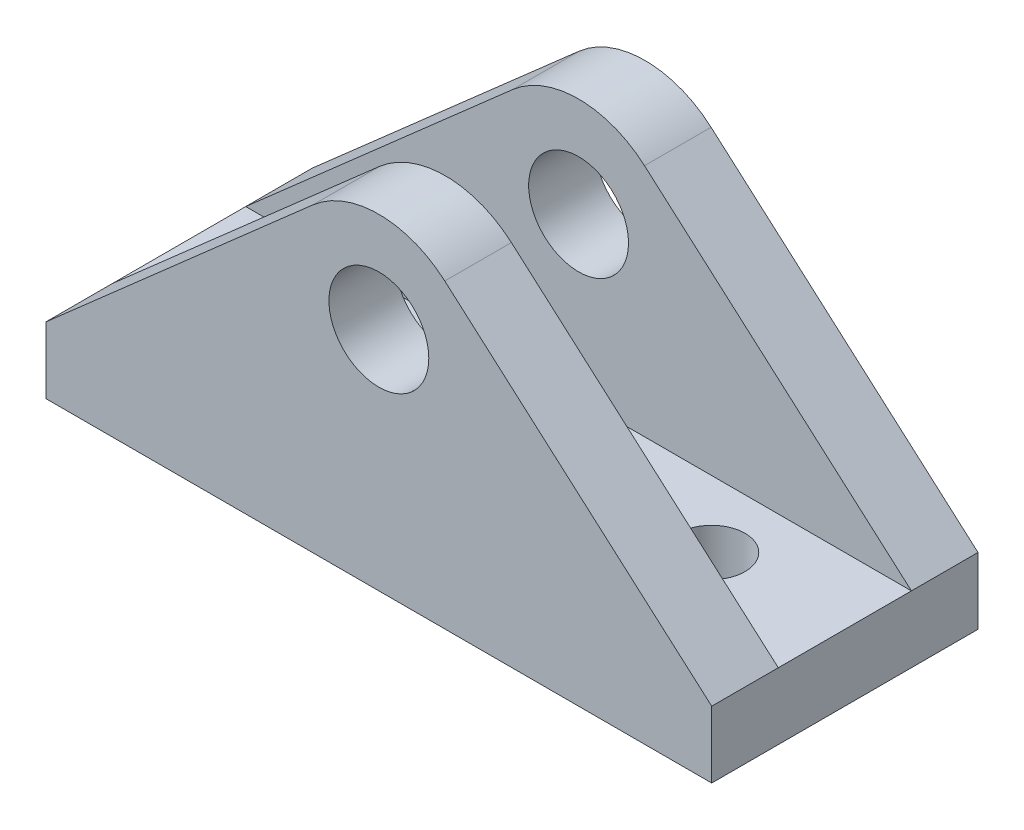
ISO-10303-21;
HEADER;
FILE_DESCRIPTION(('STEP AP214'),'2;1');
FILE_NAME('part.step','',(''),(''),'','','');
FILE_SCHEMA(('AUTOMOTIVE_DESIGN { 1 0 10303 214 1 1 1 1 }'));
ENDSEC;
DATA;
#1=APPLICATION_CONTEXT('core data for automotive mechanical design processes');
#2=APPLICATION_PROTOCOL_DEFINITION('international standard','automotive_design',2000,#1);
#3=PRODUCT_CONTEXT('',#1,'mechanical');
#4=PRODUCT('Part','Part','',(#3));
#5=PRODUCT_RELATED_PRODUCT_CATEGORY('part','',(#4));
#6=PRODUCT_DEFINITION_FORMATION('','',#4);
#7=PRODUCT_DEFINITION_CONTEXT('part definition',#1,'design');
#8=PRODUCT_DEFINITION('design','',#6,#7);
#9=PRODUCT_DEFINITION_SHAPE('','',#8);
#10=(LENGTH_UNIT() NAMED_UNIT(*) SI_UNIT(.MILLI.,.METRE.));
#11=(NAMED_UNIT(*) PLANE_ANGLE_UNIT() SI_UNIT($,.RADIAN.));
#12=(NAMED_UNIT(*) SI_UNIT($,.STERADIAN.) SOLID_ANGLE_UNIT());
#13=UNCERTAINTY_MEASURE_WITH_UNIT(LENGTH_MEASURE(1.E-05),#10,'distance_accuracy_value','');
#14=(GEOMETRIC_REPRESENTATION_CONTEXT(3) GLOBAL_UNCERTAINTY_ASSIGNED_CONTEXT((#13)) GLOBAL_UNIT_ASSIGNED_CONTEXT((#10,
#11,#12)) REPRESENTATION_CONTEXT('',''));
#15=CARTESIAN_POINT('',(0.,0.,0.));
#16=DIRECTION('',(0.,0.,1.));
#17=DIRECTION('',(1.,0.,0.));
#18=AXIS2_PLACEMENT_3D('',#15,#16,#17);
#19=CARTESIAN_POINT('',(-9.43958665267273,10.732585613282,25.4));
#20=DIRECTION('',(0.660427227284446,-0.750890056840133,0.));
#21=DIRECTION('',(0.750890056840133,0.660427227284446,0.));
#22=AXIS2_PLACEMENT_3D('',#19,#20,#21);
#23=PLANE('',#22);
#24=DIRECTION('',(-0.750890056840133,-0.660427227284446,0.));
#25=VECTOR('',#24,1.);
#26=CARTESIAN_POINT('',(-9.43958665267273,10.732585613282,6.35));
#27=LINE('',#26,#25);
#28=CARTESIAN_POINT('',(-6.29056933988435,13.5022277914023,6.35));
#29=VERTEX_POINT('',#28);
#30=CARTESIAN_POINT('',(-31.7499999999431,-8.88999999999998,6.35));
#31=VERTEX_POINT('',#30);
#32=EDGE_CURVE('E147',#29,#31,#27,.T.);
#33=ORIENTED_EDGE('',*,*,#32,.F.);
#34=DIRECTION('',(0.,0.,-1.));
#35=VECTOR('',#34,1.);
#36=CARTESIAN_POINT('',(-6.29056933988435,13.5022277914023,25.4));
#37=LINE('',#36,#35);
#38=CARTESIAN_POINT('',(-6.29056933988435,13.5022277914023,0.));
#39=VERTEX_POINT('',#38);
#40=EDGE_CURVE('E91',#29,#39,#37,.T.);
#41=ORIENTED_EDGE('',*,*,#40,.T.);
#42=DIRECTION('',(-0.750890056840133,-0.660427227284446,0.));
#43=VECTOR('',#42,1.);
#44=CARTESIAN_POINT('',(-9.43958665267273,10.732585613282,0.));
#45=LINE('',#44,#43);
#46=CARTESIAN_POINT('',(-31.7499999999431,-8.89,0.));
#47=VERTEX_POINT('',#46);
#48=EDGE_CURVE('E144',#39,#47,#45,.T.);
#49=ORIENTED_EDGE('',*,*,#48,.T.);
#50=DIRECTION('',(0.,0.,-1.));
#51=VECTOR('',#50,1.);
#52=CARTESIAN_POINT('',(-31.7499999999431,-8.89,25.4));
#53=LINE('',#52,#51);
#54=EDGE_CURVE('E45',#31,#47,#53,.T.);
#55=ORIENTED_EDGE('',*,*,#54,.F.);
#56=EDGE_LOOP('',(#33,#41,#49,#55));
#57=FACE_BOUND('',#56,.T.);
#58=ADVANCED_FACE('F36',(#57),#23,.F.);
#59=CARTESIAN_POINT('',(9.43958665267273,10.732585613282,25.4));
#60=DIRECTION('',(0.660427227284446,0.750890056840133,0.));
#61=DIRECTION('',(-0.750890056840133,0.660427227284446,0.));
#62=AXIS2_PLACEMENT_3D('',#59,#60,#61);
#63=PLANE('',#62);
#64=DIRECTION('',(0.,0.,-1.));
#65=VECTOR('',#64,1.);
#66=CARTESIAN_POINT('',(6.29056933988435,13.5022277914023,25.4));
#67=LINE('',#66,#65);
#68=CARTESIAN_POINT('',(6.29056933988435,13.5022277914023,6.35));
#69=VERTEX_POINT('',#68);
#70=CARTESIAN_POINT('',(6.29056933988435,13.5022277914023,0.));
#71=VERTEX_POINT('',#70);
#72=EDGE_CURVE('E165',#69,#71,#67,.T.);
#73=ORIENTED_EDGE('',*,*,#72,.F.);
#74=DIRECTION('',(0.750890056840133,-0.660427227284446,0.));
#75=VECTOR('',#74,1.);
#76=CARTESIAN_POINT('',(9.43958665267273,10.732585613282,6.35));
#77=LINE('',#76,#75);
#78=CARTESIAN_POINT('',(31.7499999999431,-8.88999999999998,6.35));
#79=VERTEX_POINT('',#78);
#80=EDGE_CURVE('E198',#69,#79,#77,.T.);
#81=ORIENTED_EDGE('',*,*,#80,.T.);
#82=DIRECTION('',(0.,0.,-1.));
#83=VECTOR('',#82,1.);
#84=CARTESIAN_POINT('',(31.7499999999431,-8.88999999999998,25.4));
#85=LINE('',#84,#83);
#86=CARTESIAN_POINT('',(31.7499999999431,-8.88999999999998,0.));
#87=VERTEX_POINT('',#86);
#88=EDGE_CURVE('E132',#79,#87,#85,.T.);
#89=ORIENTED_EDGE('',*,*,#88,.T.);
#90=DIRECTION('',(0.750890056840133,-0.660427227284446,0.));
#91=VECTOR('',#90,1.);
#92=CARTESIAN_POINT('',(9.43958665267273,10.732585613282,0.));
#93=LINE('',#92,#91);
#94=EDGE_CURVE('E154',#71,#87,#93,.T.);
#95=ORIENTED_EDGE('',*,*,#94,.F.);
#96=EDGE_LOOP('',(#73,#81,#89,#95));
#97=FACE_BOUND('',#96,.T.);
#98=ADVANCED_FACE('F221',(#97),#63,.T.);
#99=CARTESIAN_POINT('',(0.,6.35,25.4));
#100=DIRECTION('',(0.,0.,-1.));
#101=DIRECTION('',(-1.,0.,0.));
#102=AXIS2_PLACEMENT_3D('',#99,#100,#101);
#103=CYLINDRICAL_SURFACE('',#102,9.525);
#104=CARTESIAN_POINT('',(0.,6.35,6.35));
#105=DIRECTION('',(0.,0.,1.));
#106=DIRECTION('',(1.,0.,0.));
#107=AXIS2_PLACEMENT_3D('',#104,#105,#106);
#108=CIRCLE('',#107,9.525);
#109=EDGE_CURVE('E195',#69,#29,#108,.T.);
#110=ORIENTED_EDGE('',*,*,#109,.F.);
#111=ORIENTED_EDGE('',*,*,#72,.T.);
#112=CARTESIAN_POINT('',(0.,6.35,0.));
#113=DIRECTION('',(0.,0.,1.));
#114=DIRECTION('',(1.,0.,0.));
#115=AXIS2_PLACEMENT_3D('',#112,#113,#114);
#116=CIRCLE('',#115,9.525);
#117=EDGE_CURVE('E157',#71,#39,#116,.T.);
#118=ORIENTED_EDGE('',*,*,#117,.T.);
#119=ORIENTED_EDGE('',*,*,#40,.F.);
#120=EDGE_LOOP('',(#110,#111,#118,#119));
#121=FACE_BOUND('',#120,.T.);
#122=ADVANCED_FACE('F236',(#121),#103,.T.);
#123=CARTESIAN_POINT('',(0.,6.35,25.4));
#124=DIRECTION('',(0.,0.,-1.));
#125=DIRECTION('',(-1.,0.,0.));
#126=AXIS2_PLACEMENT_3D('',#123,#124,#125);
#127=CYLINDRICAL_SURFACE('',#126,4.7625);
#128=CARTESIAN_POINT('',(0.,6.35,0.));
#129=DIRECTION('',(0.,0.,1.));
#130=DIRECTION('',(1.,0.,0.));
#131=AXIS2_PLACEMENT_3D('',#128,#129,#130);
#132=CIRCLE('',#131,4.7625);
#133=CARTESIAN_POINT('',(4.7625,6.35,0.));
#134=VERTEX_POINT('',#133);
#135=EDGE_CURVE('E159',#134,#134,#132,.T.);
#136=ORIENTED_EDGE('',*,*,#135,.F.);
#137=EDGE_LOOP('',(#136));
#138=FACE_BOUND('',#137,.T.);
#139=CARTESIAN_POINT('',(0.,6.35,6.35));
#140=DIRECTION('',(0.,0.,1.));
#141=DIRECTION('',(1.,0.,0.));
#142=AXIS2_PLACEMENT_3D('',#139,#140,#141);
#143=CIRCLE('',#142,4.7625);
#144=CARTESIAN_POINT('',(4.7625,6.35,6.35));
#145=VERTEX_POINT('',#144);
#146=EDGE_CURVE('E40',#145,#145,#143,.T.);
#147=ORIENTED_EDGE('',*,*,#146,.T.);
#148=EDGE_LOOP('',(#147));
#149=FACE_BOUND('',#148,.T.);
#150=ADVANCED_FACE('F238',(#138,#149),#127,.F.);
#151=CARTESIAN_POINT('',(-6.29056933988435,13.5022277914023,25.4));
#152=VERTEX_POINT('',#151);
#153=CARTESIAN_POINT('',(-6.29056933988435,13.5022277914023,19.05));
#154=VERTEX_POINT('',#153);
#155=EDGE_CURVE('E162',#152,#154,#37,.T.);
#156=ORIENTED_EDGE('',*,*,#155,.T.);
#157=DIRECTION('',(-0.750890056840133,-0.660427227284446,0.));
#158=VECTOR('',#157,1.);
#159=CARTESIAN_POINT('',(-9.43958665267273,10.732585613282,19.05));
#160=LINE('',#159,#158);
#161=CARTESIAN_POINT('',(-31.7499999999431,-8.88999999999998,19.05));
#162=VERTEX_POINT('',#161);
#163=EDGE_CURVE('E53',#154,#162,#160,.T.);
#164=ORIENTED_EDGE('',*,*,#163,.T.);
#165=CARTESIAN_POINT('',(-31.7499999999431,-8.89,25.4));
#166=VERTEX_POINT('',#165);
#167=EDGE_CURVE('E11',#166,#162,#53,.T.);
#168=ORIENTED_EDGE('',*,*,#167,.F.);
#169=DIRECTION('',(-0.750890056840133,-0.660427227284446,0.));
#170=VECTOR('',#169,1.);
#171=CARTESIAN_POINT('',(-9.43958665267273,10.732585613282,25.4));
#172=LINE('',#171,#170);
#173=EDGE_CURVE('E97',#152,#166,#172,.T.);
#174=ORIENTED_EDGE('',*,*,#173,.F.);
#175=EDGE_LOOP('',(#156,#164,#168,#174));
#176=FACE_BOUND('',#175,.T.);
#177=ADVANCED_FACE('F38',(#176),#23,.F.);
#178=CARTESIAN_POINT('',(-31.7499999999431,0.,25.4));
#179=DIRECTION('',(-1.,0.,0.));
#180=DIRECTION('',(0.,0.,1.));
#181=AXIS2_PLACEMENT_3D('',#178,#179,#180);
#182=PLANE('',#181);
#183=DIRECTION('',(0.,1.,0.));
#184=VECTOR('',#183,1.);
#185=CARTESIAN_POINT('',(-31.7499999999431,0.,0.));
#186=LINE('',#185,#184);
#187=CARTESIAN_POINT('',(-31.7499999999431,-15.24,0.));
#188=VERTEX_POINT('',#187);
#189=EDGE_CURVE('E146',#188,#47,#186,.T.);
#190=ORIENTED_EDGE('',*,*,#189,.F.);
#191=DIRECTION('',(0.,0.,-1.));
#192=VECTOR('',#191,1.);
#193=CARTESIAN_POINT('',(-31.7499999999431,-15.24,25.4));
#194=LINE('',#193,#192);
#195=CARTESIAN_POINT('',(-31.7499999999431,-15.24,25.4));
#196=VERTEX_POINT('',#195);
#197=EDGE_CURVE('E168',#196,#188,#194,.T.);
#198=ORIENTED_EDGE('',*,*,#197,.F.);
#199=DIRECTION('',(0.,1.,0.));
#200=VECTOR('',#199,1.);
#201=CARTESIAN_POINT('',(-31.7499999999431,0.,25.4));
#202=LINE('',#201,#200);
#203=EDGE_CURVE('E202',#196,#166,#202,.T.);
#204=ORIENTED_EDGE('',*,*,#203,.T.);
#205=ORIENTED_EDGE('',*,*,#167,.T.);
#206=DIRECTION('',(0.,0.,1.));
#207=VECTOR('',#206,1.);
#208=CARTESIAN_POINT('',(-31.7499999999431,-8.88999999999998,0.));
#209=LINE('',#208,#207);
#210=EDGE_CURVE('E187',#31,#162,#209,.T.);
#211=ORIENTED_EDGE('',*,*,#210,.F.);
#212=ORIENTED_EDGE('',*,*,#54,.T.);
#213=EDGE_LOOP('',(#190,#198,#204,#205,#211,#212));
#214=FACE_BOUND('',#213,.T.);
#215=ADVANCED_FACE('F206',(#214),#182,.T.);
#216=CARTESIAN_POINT('',(0.,-15.24,25.4));
#217=DIRECTION('',(0.,1.,0.));
#218=DIRECTION('',(-1.,0.,0.));
#219=AXIS2_PLACEMENT_3D('',#216,#217,#218);
#220=PLANE('',#219);
#221=CARTESIAN_POINT('',(19.05,-15.24,12.7));
#222=DIRECTION('',(0.,1.,0.));
#223=DIRECTION('',(0.,0.,1.));
#224=AXIS2_PLACEMENT_3D('',#221,#222,#223);
#225=CIRCLE('',#224,3.175);
#226=CARTESIAN_POINT('',(19.05,-15.24,15.875));
#227=VERTEX_POINT('',#226);
#228=EDGE_CURVE('E261',#227,#227,#225,.T.);
#229=ORIENTED_EDGE('',*,*,#228,.T.);
#230=EDGE_LOOP('',(#229));
#231=FACE_BOUND('',#230,.T.);
#232=CARTESIAN_POINT('',(-19.05,-15.24,12.7));
#233=DIRECTION('',(0.,1.,0.));
#234=DIRECTION('',(0.,0.,1.));
#235=AXIS2_PLACEMENT_3D('',#232,#233,#234);
#236=CIRCLE('',#235,3.175);
#237=CARTESIAN_POINT('',(-19.05,-15.24,15.875));
#238=VERTEX_POINT('',#237);
#239=EDGE_CURVE('E263',#238,#238,#236,.T.);
#240=ORIENTED_EDGE('',*,*,#239,.T.);
#241=EDGE_LOOP('',(#240));
#242=FACE_BOUND('',#241,.T.);
#243=DIRECTION('',(1.,0.,0.));
#244=VECTOR('',#243,1.);
#245=CARTESIAN_POINT('',(0.,-15.24,0.));
#246=LINE('',#245,#244);
#247=CARTESIAN_POINT('',(31.7499999999431,-15.24,0.));
#248=VERTEX_POINT('',#247);
#249=EDGE_CURVE('E150',#188,#248,#246,.T.);
#250=ORIENTED_EDGE('',*,*,#249,.T.);
#251=DIRECTION('',(0.,0.,-1.));
#252=VECTOR('',#251,1.);
#253=CARTESIAN_POINT('',(31.7499999999431,-15.24,25.4));
#254=LINE('',#253,#252);
#255=CARTESIAN_POINT('',(31.7499999999431,-15.24,25.4));
#256=VERTEX_POINT('',#255);
#257=EDGE_CURVE('E131',#256,#248,#254,.T.);
#258=ORIENTED_EDGE('',*,*,#257,.F.);
#259=DIRECTION('',(1.,0.,0.));
#260=VECTOR('',#259,1.);
#261=CARTESIAN_POINT('',(0.,-15.24,25.4));
#262=LINE('',#261,#260);
#263=EDGE_CURVE('E115',#196,#256,#262,.T.);
#264=ORIENTED_EDGE('',*,*,#263,.F.);
#265=ORIENTED_EDGE('',*,*,#197,.T.);
#266=EDGE_LOOP('',(#250,#258,#264,#265));
#267=FACE_BOUND('',#266,.T.);
#268=ADVANCED_FACE('F211',(#231,#242,#267),#220,.F.);
#269=CARTESIAN_POINT('',(31.7499999999431,0.,25.4));
#270=DIRECTION('',(-1.,0.,0.));
#271=DIRECTION('',(0.,0.,1.));
#272=AXIS2_PLACEMENT_3D('',#269,#270,#271);
#273=PLANE('',#272);
#274=DIRECTION('',(0.,1.,0.));
#275=VECTOR('',#274,1.);
#276=CARTESIAN_POINT('',(31.7499999999431,0.,0.));
#277=LINE('',#276,#275);
#278=EDGE_CURVE('E152',#248,#87,#277,.T.);
#279=ORIENTED_EDGE('',*,*,#278,.T.);
#280=ORIENTED_EDGE('',*,*,#88,.F.);
#281=DIRECTION('',(0.,0.,1.));
#282=VECTOR('',#281,1.);
#283=CARTESIAN_POINT('',(31.7499999999431,-8.88999999999998,0.));
#284=LINE('',#283,#282);
#285=CARTESIAN_POINT('',(31.7499999999431,-8.88999999999998,19.05));
#286=VERTEX_POINT('',#285);
#287=EDGE_CURVE('E128',#79,#286,#284,.T.);
#288=ORIENTED_EDGE('',*,*,#287,.T.);
#289=CARTESIAN_POINT('',(31.7499999999431,-8.88999999999998,25.4));
#290=VERTEX_POINT('',#289);
#291=EDGE_CURVE('E122',#290,#286,#85,.T.);
#292=ORIENTED_EDGE('',*,*,#291,.F.);
#293=DIRECTION('',(0.,1.,0.));
#294=VECTOR('',#293,1.);
#295=CARTESIAN_POINT('',(31.7499999999431,0.,25.4));
#296=LINE('',#295,#294);
#297=EDGE_CURVE('E108',#256,#290,#296,.T.);
#298=ORIENTED_EDGE('',*,*,#297,.F.);
#299=ORIENTED_EDGE('',*,*,#257,.T.);
#300=EDGE_LOOP('',(#279,#280,#288,#292,#298,#299));
#301=FACE_BOUND('',#300,.T.);
#302=ADVANCED_FACE('F124',(#301),#273,.F.);
#303=DIRECTION('',(0.750890056840133,-0.660427227284446,0.));
#304=VECTOR('',#303,1.);
#305=CARTESIAN_POINT('',(9.43958665267273,10.732585613282,19.05));
#306=LINE('',#305,#304);
#307=CARTESIAN_POINT('',(6.29056933988435,13.5022277914023,19.05));
#308=VERTEX_POINT('',#307);
#309=EDGE_CURVE('E175',#308,#286,#306,.T.);
#310=ORIENTED_EDGE('',*,*,#309,.F.);
#311=CARTESIAN_POINT('',(6.29056933988435,13.5022277914023,25.4));
#312=VERTEX_POINT('',#311);
#313=EDGE_CURVE('E136',#312,#308,#67,.T.);
#314=ORIENTED_EDGE('',*,*,#313,.F.);
#315=DIRECTION('',(0.750890056840133,-0.660427227284446,0.));
#316=VECTOR('',#315,1.);
#317=CARTESIAN_POINT('',(9.43958665267273,10.732585613282,25.4));
#318=LINE('',#317,#316);
#319=EDGE_CURVE('E113',#312,#290,#318,.T.);
#320=ORIENTED_EDGE('',*,*,#319,.T.);
#321=ORIENTED_EDGE('',*,*,#291,.T.);
#322=EDGE_LOOP('',(#310,#314,#320,#321));
#323=FACE_BOUND('',#322,.T.);
#324=ADVANCED_FACE('F134',(#323),#63,.T.);
#325=ORIENTED_EDGE('',*,*,#313,.T.);
#326=CARTESIAN_POINT('',(0.,6.35,19.05));
#327=DIRECTION('',(0.,0.,1.));
#328=DIRECTION('',(1.,0.,0.));
#329=AXIS2_PLACEMENT_3D('',#326,#327,#328);
#330=CIRCLE('',#329,9.525);
#331=EDGE_CURVE('E171',#308,#154,#330,.T.);
#332=ORIENTED_EDGE('',*,*,#331,.T.);
#333=ORIENTED_EDGE('',*,*,#155,.F.);
#334=CARTESIAN_POINT('',(0.,6.35,25.4));
#335=DIRECTION('',(0.,0.,1.));
#336=DIRECTION('',(1.,0.,0.));
#337=AXIS2_PLACEMENT_3D('',#334,#335,#336);
#338=CIRCLE('',#337,9.525);
#339=EDGE_CURVE('E62',#312,#152,#338,.T.);
#340=ORIENTED_EDGE('',*,*,#339,.F.);
#341=EDGE_LOOP('',(#325,#332,#333,#340));
#342=FACE_BOUND('',#341,.T.);
#343=ADVANCED_FACE('F240',(#342),#103,.T.);
#344=CARTESIAN_POINT('',(0.,6.35,19.05));
#345=DIRECTION('',(0.,0.,1.));
#346=DIRECTION('',(1.,0.,0.));
#347=AXIS2_PLACEMENT_3D('',#344,#345,#346);
#348=CIRCLE('',#347,4.7625);
#349=CARTESIAN_POINT('',(4.7625,6.35,19.05));
#350=VERTEX_POINT('',#349);
#351=EDGE_CURVE('E169',#350,#350,#348,.T.);
#352=ORIENTED_EDGE('',*,*,#351,.F.);
#353=EDGE_LOOP('',(#352));
#354=FACE_BOUND('',#353,.T.);
#355=CARTESIAN_POINT('',(0.,6.35,25.4));
#356=DIRECTION('',(0.,0.,1.));
#357=DIRECTION('',(1.,0.,0.));
#358=AXIS2_PLACEMENT_3D('',#355,#356,#357);
#359=CIRCLE('',#358,4.7625);
#360=CARTESIAN_POINT('',(4.7625,6.35,25.4));
#361=VERTEX_POINT('',#360);
#362=EDGE_CURVE('E138',#361,#361,#359,.T.);
#363=ORIENTED_EDGE('',*,*,#362,.T.);
#364=EDGE_LOOP('',(#363));
#365=FACE_BOUND('',#364,.T.);
#366=ADVANCED_FACE('F247',(#354,#365),#127,.F.);
#367=CARTESIAN_POINT('',(0.,0.,25.4));
#368=DIRECTION('',(0.,0.,1.));
#369=DIRECTION('',(1.,0.,0.));
#370=AXIS2_PLACEMENT_3D('',#367,#368,#369);
#371=PLANE('',#370);
#372=ORIENTED_EDGE('',*,*,#173,.T.);
#373=ORIENTED_EDGE('',*,*,#203,.F.);
#374=ORIENTED_EDGE('',*,*,#263,.T.);
#375=ORIENTED_EDGE('',*,*,#297,.T.);
#376=ORIENTED_EDGE('',*,*,#319,.F.);
#377=ORIENTED_EDGE('',*,*,#339,.T.);
#378=EDGE_LOOP('',(#372,#373,#374,#375,#376,#377));
#379=FACE_BOUND('',#378,.T.);
#380=ORIENTED_EDGE('',*,*,#362,.F.);
#381=EDGE_LOOP('',(#380));
#382=FACE_BOUND('',#381,.T.);
#383=ADVANCED_FACE('F110',(#379,#382),#371,.T.);
#384=CARTESIAN_POINT('',(0.,0.,0.));
#385=DIRECTION('',(0.,0.,1.));
#386=DIRECTION('',(1.,0.,0.));
#387=AXIS2_PLACEMENT_3D('',#384,#385,#386);
#388=PLANE('',#387);
#389=ORIENTED_EDGE('',*,*,#48,.F.);
#390=ORIENTED_EDGE('',*,*,#117,.F.);
#391=ORIENTED_EDGE('',*,*,#94,.T.);
#392=ORIENTED_EDGE('',*,*,#278,.F.);
#393=ORIENTED_EDGE('',*,*,#249,.F.);
#394=ORIENTED_EDGE('',*,*,#189,.T.);
#395=EDGE_LOOP('',(#389,#390,#391,#392,#393,#394));
#396=FACE_BOUND('',#395,.T.);
#397=ORIENTED_EDGE('',*,*,#135,.T.);
#398=EDGE_LOOP('',(#397));
#399=FACE_BOUND('',#398,.T.);
#400=ADVANCED_FACE('F215',(#396,#399),#388,.F.);
#401=CARTESIAN_POINT('',(-31.7499999999431,0.,6.35));
#402=DIRECTION('',(0.,0.,1.));
#403=DIRECTION('',(1.,0.,0.));
#404=AXIS2_PLACEMENT_3D('',#401,#402,#403);
#405=PLANE('',#404);
#406=ORIENTED_EDGE('',*,*,#146,.F.);
#407=EDGE_LOOP('',(#406));
#408=FACE_BOUND('',#407,.T.);
#409=ORIENTED_EDGE('',*,*,#32,.T.);
#410=DIRECTION('',(1.,0.,0.));
#411=VECTOR('',#410,1.);
#412=CARTESIAN_POINT('',(-31.7499999999431,-8.88999999999998,6.35));
#413=LINE('',#412,#411);
#414=EDGE_CURVE('E172',#31,#79,#413,.T.);
#415=ORIENTED_EDGE('',*,*,#414,.T.);
#416=ORIENTED_EDGE('',*,*,#80,.F.);
#417=ORIENTED_EDGE('',*,*,#109,.T.);
#418=EDGE_LOOP('',(#409,#415,#416,#417));
#419=FACE_BOUND('',#418,.T.);
#420=ADVANCED_FACE('F233',(#408,#419),#405,.T.);
#421=CARTESIAN_POINT('',(-31.7499999999431,0.,19.05));
#422=DIRECTION('',(0.,0.,1.));
#423=DIRECTION('',(1.,0.,0.));
#424=AXIS2_PLACEMENT_3D('',#421,#422,#423);
#425=PLANE('',#424);
#426=ORIENTED_EDGE('',*,*,#351,.T.);
#427=EDGE_LOOP('',(#426));
#428=FACE_BOUND('',#427,.T.);
#429=ORIENTED_EDGE('',*,*,#331,.F.);
#430=ORIENTED_EDGE('',*,*,#309,.T.);
#431=DIRECTION('',(1.,0.,0.));
#432=VECTOR('',#431,1.);
#433=CARTESIAN_POINT('',(-31.7499999999431,-8.88999999999998,19.05));
#434=LINE('',#433,#432);
#435=EDGE_CURVE('E178',#162,#286,#434,.T.);
#436=ORIENTED_EDGE('',*,*,#435,.F.);
#437=ORIENTED_EDGE('',*,*,#163,.F.);
#438=EDGE_LOOP('',(#429,#430,#436,#437));
#439=FACE_BOUND('',#438,.T.);
#440=ADVANCED_FACE('F259',(#428,#439),#425,.F.);
#441=CARTESIAN_POINT('',(-31.7499999999431,-8.88999999999998,0.));
#442=DIRECTION('',(0.,1.,0.));
#443=DIRECTION('',(0.,0.,1.));
#444=AXIS2_PLACEMENT_3D('',#441,#442,#443);
#445=PLANE('',#444);
#446=CARTESIAN_POINT('',(19.05,-8.88999999999998,12.7));
#447=DIRECTION('',(0.,1.,0.));
#448=DIRECTION('',(0.,0.,1.));
#449=AXIS2_PLACEMENT_3D('',#446,#447,#448);
#450=CIRCLE('',#449,3.175);
#451=CARTESIAN_POINT('',(19.05,-8.88999999999998,15.875));
#452=VERTEX_POINT('',#451);
#453=EDGE_CURVE('E269',#452,#452,#450,.T.);
#454=ORIENTED_EDGE('',*,*,#453,.F.);
#455=EDGE_LOOP('',(#454));
#456=FACE_BOUND('',#455,.T.);
#457=CARTESIAN_POINT('',(-19.05,-8.88999999999998,12.7));
#458=DIRECTION('',(0.,1.,0.));
#459=DIRECTION('',(0.,0.,1.));
#460=AXIS2_PLACEMENT_3D('',#457,#458,#459);
#461=CIRCLE('',#460,3.175);
#462=CARTESIAN_POINT('',(-19.05,-8.88999999999998,15.875));
#463=VERTEX_POINT('',#462);
#464=EDGE_CURVE('E266',#463,#463,#461,.T.);
#465=ORIENTED_EDGE('',*,*,#464,.F.);
#466=EDGE_LOOP('',(#465));
#467=FACE_BOUND('',#466,.T.);
#468=ORIENTED_EDGE('',*,*,#287,.F.);
#469=ORIENTED_EDGE('',*,*,#414,.F.);
#470=ORIENTED_EDGE('',*,*,#210,.T.);
#471=ORIENTED_EDGE('',*,*,#435,.T.);
#472=EDGE_LOOP('',(#468,#469,#470,#471));
#473=FACE_BOUND('',#472,.T.);
#474=ADVANCED_FACE('F260',(#456,#467,#473),#445,.T.);
#475=CARTESIAN_POINT('',(-19.05,-15.24,12.7));
#476=DIRECTION('',(0.,1.,0.));
#477=DIRECTION('',(0.,0.,1.));
#478=AXIS2_PLACEMENT_3D('',#475,#476,#477);
#479=CYLINDRICAL_SURFACE('',#478,3.175);
#480=ORIENTED_EDGE('',*,*,#239,.F.);
#481=EDGE_LOOP('',(#480));
#482=FACE_BOUND('',#481,.T.);
#483=ORIENTED_EDGE('',*,*,#464,.T.);
#484=EDGE_LOOP('',(#483));
#485=FACE_BOUND('',#484,.T.);
#486=ADVANCED_FACE('F280',(#482,#485),#479,.F.);
#487=CARTESIAN_POINT('',(19.05,-15.24,12.7));
#488=DIRECTION('',(0.,1.,0.));
#489=DIRECTION('',(0.,0.,1.));
#490=AXIS2_PLACEMENT_3D('',#487,#488,#489);
#491=CYLINDRICAL_SURFACE('',#490,3.175);
#492=ORIENTED_EDGE('',*,*,#228,.F.);
#493=EDGE_LOOP('',(#492));
#494=FACE_BOUND('',#493,.T.);
#495=ORIENTED_EDGE('',*,*,#453,.T.);
#496=EDGE_LOOP('',(#495));
#497=FACE_BOUND('',#496,.T.);
#498=ADVANCED_FACE('F277',(#494,#497),#491,.F.);
#499=CLOSED_SHELL('',(#58,#98,#122,#150,#177,#215,#268,#302,#324,#343,#366,#383,#400,#420,#440,
#474,#486,#498));
#500=MANIFOLD_SOLID_BREP('B2',#499);
#501=ADVANCED_BREP_SHAPE_REPRESENTATION('',(#18,#500),#14);
#502=SHAPE_DEFINITION_REPRESENTATION(#9,#501);
ENDSEC;
END-ISO-10303-21;
